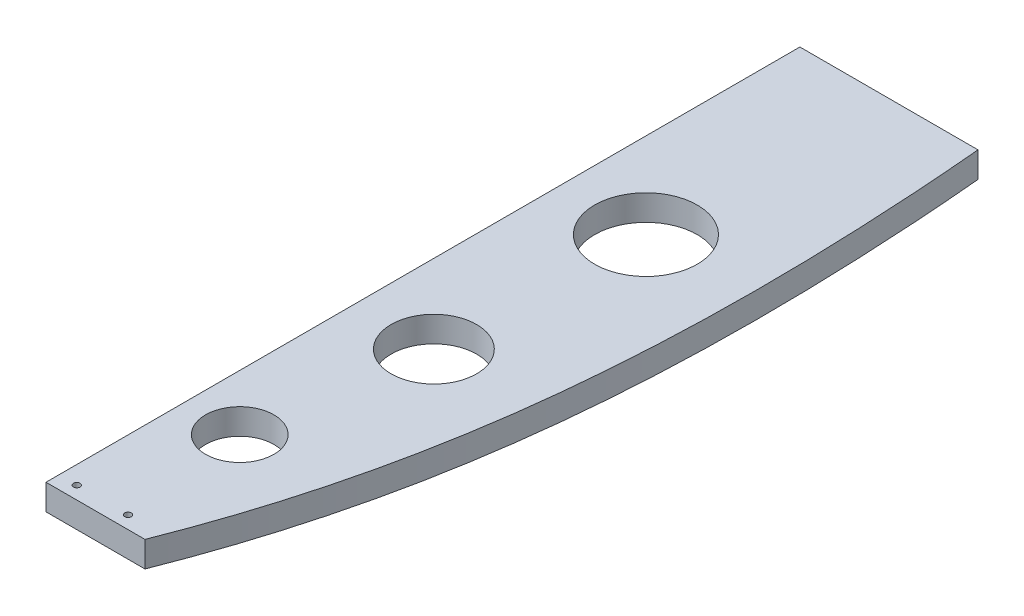
ISO-10303-21;
HEADER;
FILE_DESCRIPTION(('STEP AP214'),'2;1');
FILE_NAME('part.step','',(''),(''),'','','');
FILE_SCHEMA(('AUTOMOTIVE_DESIGN { 1 0 10303 214 1 1 1 1 }'));
ENDSEC;
DATA;
#1=APPLICATION_CONTEXT('core data for automotive mechanical design processes');
#2=APPLICATION_PROTOCOL_DEFINITION('international standard','automotive_design',2000,#1);
#3=PRODUCT_CONTEXT('',#1,'mechanical');
#4=PRODUCT('Part','Part','',(#3));
#5=PRODUCT_RELATED_PRODUCT_CATEGORY('part','',(#4));
#6=PRODUCT_DEFINITION_FORMATION('','',#4);
#7=PRODUCT_DEFINITION_CONTEXT('part definition',#1,'design');
#8=PRODUCT_DEFINITION('design','',#6,#7);
#9=PRODUCT_DEFINITION_SHAPE('','',#8);
#10=(LENGTH_UNIT() NAMED_UNIT(*) SI_UNIT(.MILLI.,.METRE.));
#11=(NAMED_UNIT(*) PLANE_ANGLE_UNIT() SI_UNIT($,.RADIAN.));
#12=(NAMED_UNIT(*) SI_UNIT($,.STERADIAN.) SOLID_ANGLE_UNIT());
#13=UNCERTAINTY_MEASURE_WITH_UNIT(LENGTH_MEASURE(1.E-05),#10,'distance_accuracy_value','');
#14=(GEOMETRIC_REPRESENTATION_CONTEXT(3) GLOBAL_UNCERTAINTY_ASSIGNED_CONTEXT((#13)) GLOBAL_UNIT_ASSIGNED_CONTEXT((#10,
#11,#12)) REPRESENTATION_CONTEXT('',''));
#15=CARTESIAN_POINT('',(0.,0.,0.));
#16=DIRECTION('',(0.,0.,1.));
#17=DIRECTION('',(1.,0.,0.));
#18=AXIS2_PLACEMENT_3D('',#15,#16,#17);
#19=CARTESIAN_POINT('',(395.938510352721,5549.9,2963.39820667187));
#20=DIRECTION('',(0.,1.,0.));
#21=DIRECTION('',(-1.,0.,0.));
#22=AXIS2_PLACEMENT_3D('',#19,#20,#21);
#23=PLANE('',#22);
#24=CARTESIAN_POINT('',(376.528681754789,5549.9,3233.76141324194));
#25=DIRECTION('',(0.,1.,0.));
#26=DIRECTION('',(-1.,0.,0.));
#27=AXIS2_PLACEMENT_3D('',#24,#25,#26);
#28=CIRCLE('',#27,2.45744999999997);
#29=CARTESIAN_POINT('',(374.071231754789,5549.9,3233.76141324194));
#30=VERTEX_POINT('',#29);
#31=EDGE_CURVE('E461',#30,#30,#28,.T.);
#32=ORIENTED_EDGE('',*,*,#31,.T.);
#33=EDGE_LOOP('',(#32));
#34=FACE_BOUND('',#33,.T.);
#35=CARTESIAN_POINT('',(338.428578956982,5549.9,3233.76141324205));
#36=DIRECTION('',(0.,1.,0.));
#37=DIRECTION('',(-1.,0.,0.));
#38=AXIS2_PLACEMENT_3D('',#35,#36,#37);
#39=CIRCLE('',#38,2.45744999999997);
#40=CARTESIAN_POINT('',(335.971128956982,5549.9,3233.76141324205));
#41=VERTEX_POINT('',#40);
#42=EDGE_CURVE('E114',#41,#41,#39,.T.);
#43=ORIENTED_EDGE('',*,*,#42,.T.);
#44=EDGE_LOOP('',(#43));
#45=FACE_BOUND('',#44,.T.);
#46=CARTESIAN_POINT('',(388.619999999984,5549.9,2861.31));
#47=DIRECTION('',(0.,1.,0.));
#48=DIRECTION('',(-1.,0.,0.));
#49=AXIS2_PLACEMENT_3D('',#46,#47,#48);
#50=CIRCLE('',#49,38.0999999999997);
#51=CARTESIAN_POINT('',(350.519999999985,5549.9,2861.31));
#52=VERTEX_POINT('',#51);
#53=EDGE_CURVE('E156',#52,#52,#50,.T.);
#54=ORIENTED_EDGE('',*,*,#53,.T.);
#55=EDGE_LOOP('',(#54));
#56=FACE_BOUND('',#55,.T.);
#57=CARTESIAN_POINT('',(383.539999999984,5549.9,3013.71));
#58=DIRECTION('',(0.,1.,0.));
#59=DIRECTION('',(-1.,0.,0.));
#60=AXIS2_PLACEMENT_3D('',#57,#58,#59);
#61=CIRCLE('',#60,31.75);
#62=CARTESIAN_POINT('',(351.789999999984,5549.9,3013.71));
#63=VERTEX_POINT('',#62);
#64=EDGE_CURVE('E486',#63,#63,#61,.T.);
#65=ORIENTED_EDGE('',*,*,#64,.T.);
#66=EDGE_LOOP('',(#65));
#67=FACE_BOUND('',#66,.T.);
#68=CARTESIAN_POINT('',(366.394999999984,5549.9,3140.71));
#69=DIRECTION('',(0.,1.,0.));
#70=DIRECTION('',(-1.,0.,0.));
#71=AXIS2_PLACEMENT_3D('',#68,#69,#70);
#72=CIRCLE('',#71,25.4);
#73=CARTESIAN_POINT('',(340.994999999984,5549.9,3140.71));
#74=VERTEX_POINT('',#73);
#75=EDGE_CURVE('E170',#74,#74,#72,.T.);
#76=ORIENTED_EDGE('',*,*,#75,.T.);
#77=EDGE_LOOP('',(#76));
#78=FACE_BOUND('',#77,.T.);
#79=DIRECTION('',(0.,0.,1.));
#80=VECTOR('',#79,1.);
#81=CARTESIAN_POINT('',(325.12,5549.9,2683.51));
#82=LINE('',#81,#80);
#83=CARTESIAN_POINT('',(325.12,5549.9,2683.51));
#84=VERTEX_POINT('',#83);
#85=CARTESIAN_POINT('',(325.12,5549.9,3243.28641334377));
#86=VERTEX_POINT('',#85);
#87=EDGE_CURVE('E162',#84,#86,#82,.T.);
#88=ORIENTED_EDGE('',*,*,#87,.F.);
#89=DIRECTION('',(-1.,0.,0.));
#90=VECTOR('',#89,1.);
#91=CARTESIAN_POINT('',(457.383176281734,5549.9,2683.51));
#92=LINE('',#91,#90);
#93=CARTESIAN_POINT('',(457.383176281734,5549.9,2683.51));
#94=VERTEX_POINT('',#93);
#95=EDGE_CURVE('E163',#94,#84,#92,.T.);
#96=ORIENTED_EDGE('',*,*,#95,.F.);
#97=CARTESIAN_POINT('',(398.616067459075,5549.9,3243.28641334377));
#98=CARTESIAN_POINT('',(399.391254354249,5549.9,3241.31643941946));
#99=CARTESIAN_POINT('',(400.159771946542,5549.9,3239.34384037501));
#100=CARTESIAN_POINT('',(401.683308273386,5549.9,3235.39352604281));
#101=CARTESIAN_POINT('',(402.438327540984,5549.9,3233.41581096063));
#102=CARTESIAN_POINT('',(403.934753074234,5549.9,3229.45528302953));
#103=CARTESIAN_POINT('',(404.676159617437,5549.9,3227.47247028548));
#104=CARTESIAN_POINT('',(406.145485254066,5549.9,3223.50115186715));
#105=CARTESIAN_POINT('',(406.873400073381,5549.9,3221.51264461165));
#106=CARTESIAN_POINT('',(408.315409595479,5549.9,3217.53057616089));
#107=CARTESIAN_POINT('',(409.029504010926,5549.9,3215.53701486152));
#108=CARTESIAN_POINT('',(410.443784650398,5549.9,3211.54487773681));
#109=CARTESIAN_POINT('',(411.143970279183,5549.9,3209.54630170097));
#110=CARTESIAN_POINT('',(413.924796825673,5549.9,3201.51873163861));
#111=CARTESIAN_POINT('',(415.948841486582,5549.9,3195.46999950884));
#112=CARTESIAN_POINT('',(419.867867500471,5549.9,3183.33007269644));
#113=CARTESIAN_POINT('',(421.762832082676,5549.9,3177.23887260906));
#114=CARTESIAN_POINT('',(425.422427121145,5549.9,3165.01700514526));
#115=CARTESIAN_POINT('',(427.187049310552,5549.9,3158.88633529227));
#116=CARTESIAN_POINT('',(430.585512685608,5549.9,3146.58889174867));
#117=CARTESIAN_POINT('',(432.219354382257,5549.9,3140.42211819922));
#118=CARTESIAN_POINT('',(435.357372122892,5549.9,3128.05321738843));
#119=CARTESIAN_POINT('',(436.86149932901,5549.9,3121.85107774053));
#120=CARTESIAN_POINT('',(439.740649568868,5549.9,3109.41710957125));
#121=CARTESIAN_POINT('',(441.115676283978,5549.9,3103.18528190178));
#122=CARTESIAN_POINT('',(443.738657817965,5549.9,3090.69501786939));
#123=CARTESIAN_POINT('',(444.986613882393,5549.9,3084.43658176791));
#124=CARTESIAN_POINT('',(447.358070937325,5549.9,3071.89634733286));
#125=CARTESIAN_POINT('',(448.481574270177,5549.9,3065.61454944128));
#126=CARTESIAN_POINT('',(450.9592027724,5549.9,3050.94728471009));
#127=CARTESIAN_POINT('',(452.266536668403,5549.9,3042.553883485));
#128=CARTESIAN_POINT('',(454.674970323465,5549.9,3025.73760485585));
#129=CARTESIAN_POINT('',(455.776068123823,5549.9,3017.3147271726));
#130=CARTESIAN_POINT('',(457.781734473296,5549.9,3000.44559812987));
#131=CARTESIAN_POINT('',(458.686301386225,5549.9,2991.99934657639));
#132=CARTESIAN_POINT('',(460.309158182782,5549.9,2975.08983570134));
#133=CARTESIAN_POINT('',(461.027464844443,5549.9,2966.62657798091));
#134=CARTESIAN_POINT('',(462.288581630136,5549.9,2949.68715658898));
#135=CARTESIAN_POINT('',(462.831394684957,5549.9,2941.21099313538));
#136=CARTESIAN_POINT('',(463.522040592226,5549.9,2928.49034900381));
#137=CARTESIAN_POINT('',(463.73165863672,5549.9,2924.2491150432));
#138=CARTESIAN_POINT('',(464.111045111048,5549.9,2915.76485644083));
#139=CARTESIAN_POINT('',(464.280813611034,5549.9,2911.52183180224));
#140=CARTESIAN_POINT('',(464.543893782736,5549.9,2904.10341936462));
#141=CARTESIAN_POINT('',(464.645692509932,5549.9,2900.92832853059));
#142=CARTESIAN_POINT('',(464.782642510266,5549.9,2896.16524637707));
#143=CARTESIAN_POINT('',(464.825667804945,5549.9,2894.57747907896));
#144=CARTESIAN_POINT('',(464.906437301377,5549.9,2891.40180867515));
#145=CARTESIAN_POINT('',(464.944181497302,5549.9,2889.81390556928));
#146=CARTESIAN_POINT('',(465.049630713982,5549.9,2885.05012986422));
#147=CARTESIAN_POINT('',(465.109555502826,5549.9,2881.87408139542));
#148=CARTESIAN_POINT('',(465.209293669797,5549.9,2875.52166888438));
#149=CARTESIAN_POINT('',(465.24910699861,5549.9,2872.34530484138));
#150=CARTESIAN_POINT('',(465.339279193302,5549.9,2862.81707241095));
#151=CARTESIAN_POINT('',(465.360395446423,5549.9,2856.46490585253));
#152=CARTESIAN_POINT('',(465.328911747632,5549.9,2843.76069302108));
#153=CARTESIAN_POINT('',(465.276310667106,5549.9,2837.40864675138));
#154=CARTESIAN_POINT('',(465.10371715051,5549.9,2824.90056477656));
#155=CARTESIAN_POINT('',(464.985843659626,5549.9,2818.74449953624));
#156=CARTESIAN_POINT('',(464.687072530091,5549.9,2806.43379985709));
#157=CARTESIAN_POINT('',(464.506173786314,5549.9,2800.27916544525));
#158=CARTESIAN_POINT('',(464.083727288669,5549.9,2787.97184820662));
#159=CARTESIAN_POINT('',(463.842178185526,5549.9,2781.81916542631));
#160=CARTESIAN_POINT('',(463.300390781291,5549.9,2769.51628781189));
#161=CARTESIAN_POINT('',(463.000151506003,5549.9,2763.36609302079));
#162=CARTESIAN_POINT('',(462.342479114975,5549.9,2751.06749509507));
#163=CARTESIAN_POINT('',(461.98503422991,5549.9,2744.91909259054));
#164=CARTESIAN_POINT('',(461.214161076097,5549.9,2732.62589828629));
#165=CARTESIAN_POINT('',(460.800733667989,5549.9,2726.48110643251));
#166=CARTESIAN_POINT('',(459.918658659862,5549.9,2714.19573926707));
#167=CARTESIAN_POINT('',(459.450013380929,5549.9,2708.05516378908));
#168=CARTESIAN_POINT('',(458.705858250388,5549.9,2698.84786595679));
#169=CARTESIAN_POINT('',(458.450951410517,5549.9,2695.77946560644));
#170=CARTESIAN_POINT('',(457.927384186114,5549.9,2689.64383870023));
#171=CARTESIAN_POINT('',(457.658723802265,5549.9,2686.57661214431));
#172=CARTESIAN_POINT('',(457.383176281734,5549.9,2683.51));
#173=B_SPLINE_CURVE_WITH_KNOTS('',3,(#97,#98,#99,#100,#101,#102,#103,#104,#105,#106,#107,#108,
#109,#110,#111,#112,#113,#114,#115,#116,#117,#118,#119,#120,#121,#122,#123,#124,#125,#126,#127,
#128,#129,#130,#131,#132,#133,#134,#135,#136,#137,#138,#139,#140,#141,#142,#143,#144,#145,#146,
#147,#148,#149,#150,#151,#152,#153,#154,#155,#156,#157,#158,#159,#160,#161,#162,#163,#164,#165,
#166,#167,#168,#169,#170,#171,#172),.UNSPECIFIED.,.F.,.F.,(4,2,2,2,2,2,2,2,2,2,2,2,2,2,2,2,2,2,
2,2,2,2,2,2,2,2,2,2,2,2,2,2,2,2,2,2,2,4),(0.,6.35100513389818,12.7017589115666,19.0523830586233,
25.4049858028807,31.7577204810343,38.110726446763,57.2443005221602,76.3803558108264,
95.5176237474086,114.654816904936,133.799184095804,152.943005208753,172.086638655152,
191.229911734633,216.710911962581,242.192154180931,267.673608531116,293.152766753605,
318.631499445493,331.370582215211,344.109642558367,353.639740098638,358.404782446424,
363.169830052399,372.699596689318,382.229386692556,401.285492509783,420.34189008003,
438.813133582084,457.284700987463,475.756679362759,494.228964380042,512.705054731665,
531.18086107531,549.655891064217,558.892775373889,568.129659224019),.UNSPECIFIED.);
#174=CARTESIAN_POINT('',(398.616067459075,5549.9,3243.28641334377));
#175=VERTEX_POINT('',#174);
#176=EDGE_CURVE('E81',#175,#94,#173,.T.);
#177=ORIENTED_EDGE('',*,*,#176,.F.);
#178=DIRECTION('',(1.,0.,0.));
#179=VECTOR('',#178,1.);
#180=CARTESIAN_POINT('',(325.12,5549.9,3243.28641334377));
#181=LINE('',#180,#179);
#182=EDGE_CURVE('E188',#86,#175,#181,.T.);
#183=ORIENTED_EDGE('',*,*,#182,.F.);
#184=EDGE_LOOP('',(#88,#96,#177,#183));
#185=FACE_BOUND('',#184,.T.);
#186=ADVANCED_FACE('F35',(#34,#45,#56,#67,#78,#185),#23,.F.);
#187=CARTESIAN_POINT('',(325.12,5549.9,3243.28641334377));
#188=DIRECTION('',(0.,0.,1.));
#189=DIRECTION('',(1.,0.,0.));
#190=AXIS2_PLACEMENT_3D('',#187,#188,#189);
#191=PLANE('',#190);
#192=DIRECTION('',(-1.,0.,0.));
#193=VECTOR('',#192,1.);
#194=CARTESIAN_POINT('',(395.938510352721,5568.95,3243.28641334377));
#195=LINE('',#194,#193);
#196=CARTESIAN_POINT('',(325.12,5568.95,3243.28641334377));
#197=VERTEX_POINT('',#196);
#198=CARTESIAN_POINT('',(398.616067459077,5568.95,3243.28641334377));
#199=VERTEX_POINT('',#198);
#200=EDGE_CURVE('E153',#197,#199,#195,.F.);
#201=ORIENTED_EDGE('',*,*,#200,.F.);
#202=DIRECTION('',(0.,-1.,0.));
#203=VECTOR('',#202,1.);
#204=CARTESIAN_POINT('',(325.12,5549.9,3243.28641334377));
#205=LINE('',#204,#203);
#206=EDGE_CURVE('E171',#86,#197,#205,.F.);
#207=ORIENTED_EDGE('',*,*,#206,.F.);
#208=ORIENTED_EDGE('',*,*,#182,.T.);
#209=DIRECTION('',(-1.36956646082368E-13,-1.,0.));
#210=VECTOR('',#209,1.);
#211=CARTESIAN_POINT('',(398.616067459076,5559.425,3243.28641334377));
#212=LINE('',#211,#210);
#213=EDGE_CURVE('E174',#199,#175,#212,.T.);
#214=ORIENTED_EDGE('',*,*,#213,.F.);
#215=EDGE_LOOP('',(#201,#207,#208,#214));
#216=FACE_BOUND('',#215,.T.);
#217=ADVANCED_FACE('F232',(#216),#191,.T.);
#218=CARTESIAN_POINT('',(398.616067459075,5549.9,3243.28641334377));
#219=CARTESIAN_POINT('',(398.616067459077,5568.95,3243.28641334377));
#220=CARTESIAN_POINT('',(438.958601174539,5549.9,3140.76412449457));
#221=CARTESIAN_POINT('',(438.958601174542,5568.95,3140.76412449457));
#222=CARTESIAN_POINT('',(461.136779739803,5549.9,3031.41462020298));
#223=CARTESIAN_POINT('',(461.136779739803,5568.95,3031.41462020298));
#224=CARTESIAN_POINT('',(466.748734721918,5549.9,2823.19952309334));
#225=CARTESIAN_POINT('',(466.748734721918,5568.95,2823.19952309334));
#226=CARTESIAN_POINT('',(463.282210542618,5549.9,2749.16015817366));
#227=CARTESIAN_POINT('',(463.282210542618,5568.95,2749.16015817366));
#228=CARTESIAN_POINT('',(457.383176281734,5549.9,2683.51));
#229=CARTESIAN_POINT('',(457.383176281734,5568.95,2683.51));
#230=B_SPLINE_SURFACE_WITH_KNOTS('',3,1,((#218,#219),(#220,#221),(#222,#223),(#224,#225),(#226,
#227),(#228,#229)),.UNSPECIFIED.,.F.,.F.,.F.,(4,2,4),(2,2),(-55.3716029639308,-25.0699273348478,
-9.0667694452729),(0.,1.90499999999997),.UNSPECIFIED.);
#231=CARTESIAN_POINT('',(398.616067459077,5568.95,3243.28641334377));
#232=CARTESIAN_POINT('',(399.391254354252,5568.95,3241.31643941946));
#233=CARTESIAN_POINT('',(400.159771946544,5568.95,3239.34384037501));
#234=CARTESIAN_POINT('',(401.683308273389,5568.95,3235.39352604281));
#235=CARTESIAN_POINT('',(402.438327540987,5568.95,3233.41581096063));
#236=CARTESIAN_POINT('',(403.934753074236,5568.95,3229.45528302953));
#237=CARTESIAN_POINT('',(404.67615961744,5568.95,3227.47247028548));
#238=CARTESIAN_POINT('',(406.145485254068,5568.95,3223.50115186715));
#239=CARTESIAN_POINT('',(406.873400073383,5568.95,3221.51264461165));
#240=CARTESIAN_POINT('',(408.315409595482,5568.95,3217.53057616089));
#241=CARTESIAN_POINT('',(409.029504010929,5568.95,3215.53701486152));
#242=CARTESIAN_POINT('',(410.443784650401,5568.95,3211.54487773681));
#243=CARTESIAN_POINT('',(411.143970279186,5568.95,3209.54630170097));
#244=CARTESIAN_POINT('',(413.924796825675,5568.95,3201.51873163861));
#245=CARTESIAN_POINT('',(415.948841486584,5568.95,3195.46999950884));
#246=CARTESIAN_POINT('',(419.867867500473,5568.95,3183.33007269644));
#247=CARTESIAN_POINT('',(421.762832082679,5568.95,3177.23887260905));
#248=CARTESIAN_POINT('',(425.422427121148,5568.95,3165.01700514525));
#249=CARTESIAN_POINT('',(427.187049310555,5568.95,3158.88633529227));
#250=CARTESIAN_POINT('',(430.58551268561,5568.95,3146.58889174867));
#251=CARTESIAN_POINT('',(432.21935438226,5568.95,3140.42211819922));
#252=CARTESIAN_POINT('',(435.357372122894,5568.95,3128.05321738843));
#253=CARTESIAN_POINT('',(436.861499329012,5568.95,3121.85107774053));
#254=CARTESIAN_POINT('',(439.74064956887,5568.95,3109.41710957125));
#255=CARTESIAN_POINT('',(441.11567628398,5568.95,3103.18528190178));
#256=CARTESIAN_POINT('',(443.738657817967,5568.95,3090.69501786939));
#257=CARTESIAN_POINT('',(444.986613882395,5568.95,3084.43658176791));
#258=CARTESIAN_POINT('',(447.358070937327,5568.95,3071.89634733286));
#259=CARTESIAN_POINT('',(448.481574270178,5568.95,3065.61454944128));
#260=CARTESIAN_POINT('',(450.959202772401,5568.95,3050.94728471008));
#261=CARTESIAN_POINT('',(452.266536668404,5568.95,3042.553883485));
#262=CARTESIAN_POINT('',(454.674970323466,5568.95,3025.73760485584));
#263=CARTESIAN_POINT('',(455.776068123824,5568.95,3017.3147271726));
#264=CARTESIAN_POINT('',(457.781734473297,5568.95,3000.44559812987));
#265=CARTESIAN_POINT('',(458.686301386226,5568.95,2991.99934657639));
#266=CARTESIAN_POINT('',(460.309158182783,5568.95,2975.08983570133));
#267=CARTESIAN_POINT('',(461.027464844443,5568.95,2966.62657798091));
#268=CARTESIAN_POINT('',(462.288581630136,5568.95,2949.68715658898));
#269=CARTESIAN_POINT('',(462.831394684957,5568.95,2941.21099313538));
#270=CARTESIAN_POINT('',(463.522040592226,5568.95,2928.49034900381));
#271=CARTESIAN_POINT('',(463.73165863672,5568.95,2924.2491150432));
#272=CARTESIAN_POINT('',(464.111045111048,5568.95,2915.76485644083));
#273=CARTESIAN_POINT('',(464.280813611034,5568.95,2911.52183180224));
#274=CARTESIAN_POINT('',(464.543893782736,5568.95,2904.10341936462));
#275=CARTESIAN_POINT('',(464.645692509933,5568.95,2900.92832853059));
#276=CARTESIAN_POINT('',(464.782642510266,5568.95,2896.16524637706));
#277=CARTESIAN_POINT('',(464.825667804945,5568.95,2894.57747907896));
#278=CARTESIAN_POINT('',(464.906437301377,5568.95,2891.40180867514));
#279=CARTESIAN_POINT('',(464.944181497302,5568.95,2889.81390556928));
#280=CARTESIAN_POINT('',(465.049630713982,5568.95,2885.05012986421));
#281=CARTESIAN_POINT('',(465.109555502827,5568.95,2881.87408139542));
#282=CARTESIAN_POINT('',(465.209293669797,5568.95,2875.52166888437));
#283=CARTESIAN_POINT('',(465.24910699861,5568.95,2872.34530484138));
#284=CARTESIAN_POINT('',(465.339279193302,5568.95,2862.81707241094));
#285=CARTESIAN_POINT('',(465.360395446423,5568.95,2856.46490585253));
#286=CARTESIAN_POINT('',(465.328911747632,5568.95,2843.76069302108));
#287=CARTESIAN_POINT('',(465.276310667106,5568.95,2837.40864675138));
#288=CARTESIAN_POINT('',(465.10371715051,5568.95,2824.90056477656));
#289=CARTESIAN_POINT('',(464.985843659626,5568.95,2818.74449953624));
#290=CARTESIAN_POINT('',(464.687072530091,5568.95,2806.43379985709));
#291=CARTESIAN_POINT('',(464.506173786313,5568.95,2800.27916544525));
#292=CARTESIAN_POINT('',(464.083727288669,5568.95,2787.97184820662));
#293=CARTESIAN_POINT('',(463.842178185526,5568.95,2781.81916542631));
#294=CARTESIAN_POINT('',(463.300390781291,5568.95,2769.51628781189));
#295=CARTESIAN_POINT('',(463.000151506003,5568.95,2763.36609302078));
#296=CARTESIAN_POINT('',(462.342479114975,5568.95,2751.06749509507));
#297=CARTESIAN_POINT('',(461.98503422991,5568.95,2744.91909259054));
#298=CARTESIAN_POINT('',(461.214161076097,5568.95,2732.62589828628));
#299=CARTESIAN_POINT('',(460.800733667989,5568.95,2726.48110643251));
#300=CARTESIAN_POINT('',(459.918658659862,5568.95,2714.19573926707));
#301=CARTESIAN_POINT('',(459.450013380929,5568.95,2708.05516378908));
#302=CARTESIAN_POINT('',(458.705858250388,5568.95,2698.84786595678));
#303=CARTESIAN_POINT('',(458.450951410517,5568.95,2695.77946560644));
#304=CARTESIAN_POINT('',(457.927384186114,5568.95,2689.64383870023));
#305=CARTESIAN_POINT('',(457.658723802265,5568.95,2686.57661214431));
#306=CARTESIAN_POINT('',(457.383176281734,5568.95,2683.51));
#307=B_SPLINE_CURVE_WITH_KNOTS('',3,(#231,#232,#233,#234,#235,#236,#237,#238,#239,#240,#241,
#242,#243,#244,#245,#246,#247,#248,#249,#250,#251,#252,#253,#254,#255,#256,#257,#258,#259,#260,
#261,#262,#263,#264,#265,#266,#267,#268,#269,#270,#271,#272,#273,#274,#275,#276,#277,#278,#279,
#280,#281,#282,#283,#284,#285,#286,#287,#288,#289,#290,#291,#292,#293,#294,#295,#296,#297,#298,
#299,#300,#301,#302,#303,#304,#305,#306),.UNSPECIFIED.,.F.,.F.,(4,2,2,2,2,2,2,2,2,2,2,2,2,2,2,2,
2,2,2,2,2,2,2,2,2,2,2,2,2,2,2,2,2,2,2,2,2,4),(0.,6.35100513389873,12.7017589115675,
19.052383058624,25.4049858028812,31.7577204810353,38.1107264467643,57.2443005221619,
76.3803558108276,95.5176237474098,114.654816904938,133.799184095806,152.943005208755,
172.086638655154,191.229911734635,216.710911962584,242.192154180932,267.673608531119,
293.152766753607,318.631499445496,331.370582215213,344.109642558369,353.63974009864,
358.404782446426,363.169830052401,372.69959668932,382.229386692558,401.285492509786,
420.341890080032,438.813133582086,457.284700987465,475.756679362761,494.228964380043,
512.705054731665,531.180861075311,549.655891064217,558.892775373888,568.129659224018),.UNSPECIFIED.);
#308=CARTESIAN_POINT('',(457.383176281734,5568.95,2683.51));
#309=VERTEX_POINT('',#308);
#310=EDGE_CURVE('E150',#199,#309,#307,.T.);
#311=DIRECTION('',(0.,1.,0.));
#312=VECTOR('',#311,1.);
#313=CARTESIAN_POINT('',(457.383176281734,5549.9,2683.51));
#314=LINE('',#313,#312);
#315=EDGE_CURVE('E159',#309,#94,#314,.F.);
#316=ORIENTED_EDGE('',*,*,#310,.F.);
#317=ORIENTED_EDGE('',*,*,#213,.T.);
#318=ORIENTED_EDGE('',*,*,#176,.T.);
#319=ORIENTED_EDGE('',*,*,#315,.F.);
#320=EDGE_LOOP('',(#316,#317,#318,#319));
#321=FACE_BOUND('',#320,.T.);
#322=ADVANCED_FACE('F37',(#321),#230,.T.);
#323=CARTESIAN_POINT('',(457.383176281734,5549.9,2683.51));
#324=DIRECTION('',(0.,0.,-1.));
#325=DIRECTION('',(-1.,0.,0.));
#326=AXIS2_PLACEMENT_3D('',#323,#324,#325);
#327=PLANE('',#326);
#328=CARTESIAN_POINT('',(424.072610901228,5559.425,2683.51));
#329=DIRECTION('',(0.,0.,-1.));
#330=DIRECTION('',(-1.,0.,0.));
#331=AXIS2_PLACEMENT_3D('',#328,#329,#330);
#332=CIRCLE('',#331,0.991870000000006);
#333=CARTESIAN_POINT('',(423.080740901228,5559.425,2683.51));
#334=VERTEX_POINT('',#333);
#335=EDGE_CURVE('E141',#334,#334,#332,.T.);
#336=ORIENTED_EDGE('',*,*,#335,.F.);
#337=EDGE_LOOP('',(#336));
#338=FACE_BOUND('',#337,.T.);
#339=CARTESIAN_POINT('',(358.104203633743,5559.425,2683.51));
#340=DIRECTION('',(0.,0.,-1.));
#341=DIRECTION('',(-1.,0.,0.));
#342=AXIS2_PLACEMENT_3D('',#339,#340,#341);
#343=CIRCLE('',#342,0.991870000000006);
#344=CARTESIAN_POINT('',(357.112333633743,5559.425,2683.51));
#345=VERTEX_POINT('',#344);
#346=EDGE_CURVE('E145',#345,#345,#343,.T.);
#347=ORIENTED_EDGE('',*,*,#346,.F.);
#348=EDGE_LOOP('',(#347));
#349=FACE_BOUND('',#348,.T.);
#350=DIRECTION('',(-1.,0.,0.));
#351=VECTOR('',#350,1.);
#352=CARTESIAN_POINT('',(395.938510352721,5568.95,2683.51));
#353=LINE('',#352,#351);
#354=CARTESIAN_POINT('',(325.12,5568.95,2683.51));
#355=VERTEX_POINT('',#354);
#356=EDGE_CURVE('E146',#309,#355,#353,.T.);
#357=ORIENTED_EDGE('',*,*,#356,.F.);
#358=ORIENTED_EDGE('',*,*,#315,.T.);
#359=ORIENTED_EDGE('',*,*,#95,.T.);
#360=DIRECTION('',(0.,-1.,0.));
#361=VECTOR('',#360,1.);
#362=CARTESIAN_POINT('',(325.12,5549.9,2683.51));
#363=LINE('',#362,#361);
#364=EDGE_CURVE('E57',#355,#84,#363,.T.);
#365=ORIENTED_EDGE('',*,*,#364,.F.);
#366=EDGE_LOOP('',(#357,#358,#359,#365));
#367=FACE_BOUND('',#366,.T.);
#368=ADVANCED_FACE('F227',(#338,#349,#367),#327,.T.);
#369=CARTESIAN_POINT('',(325.12,5549.9,2683.51));
#370=DIRECTION('',(-1.,0.,0.));
#371=DIRECTION('',(0.,-1.,0.));
#372=AXIS2_PLACEMENT_3D('',#369,#370,#371);
#373=PLANE('',#372);
#374=CARTESIAN_POINT('',(325.12,5559.425,2785.11));
#375=DIRECTION('',(-1.,0.,0.));
#376=DIRECTION('',(0.,-1.,0.));
#377=AXIS2_PLACEMENT_3D('',#374,#375,#376);
#378=CIRCLE('',#377,0.991870000000006);
#379=CARTESIAN_POINT('',(325.12,5558.43313,2785.11));
#380=VERTEX_POINT('',#379);
#381=EDGE_CURVE('E42',#380,#380,#378,.T.);
#382=ORIENTED_EDGE('',*,*,#381,.F.);
#383=EDGE_LOOP('',(#382));
#384=FACE_BOUND('',#383,.T.);
#385=CARTESIAN_POINT('',(325.12,5559.425,2886.71));
#386=DIRECTION('',(-1.,0.,0.));
#387=DIRECTION('',(0.,-1.,0.));
#388=AXIS2_PLACEMENT_3D('',#385,#386,#387);
#389=CIRCLE('',#388,0.991870000000006);
#390=CARTESIAN_POINT('',(325.12,5558.43313,2886.71));
#391=VERTEX_POINT('',#390);
#392=EDGE_CURVE('E125',#391,#391,#389,.T.);
#393=ORIENTED_EDGE('',*,*,#392,.F.);
#394=EDGE_LOOP('',(#393));
#395=FACE_BOUND('',#394,.T.);
#396=CARTESIAN_POINT('',(325.12,5559.425,2988.31));
#397=DIRECTION('',(-1.,0.,0.));
#398=DIRECTION('',(0.,-1.,0.));
#399=AXIS2_PLACEMENT_3D('',#396,#397,#398);
#400=CIRCLE('',#399,0.991870000000006);
#401=CARTESIAN_POINT('',(325.12,5558.43313,2988.31));
#402=VERTEX_POINT('',#401);
#403=EDGE_CURVE('E129',#402,#402,#400,.T.);
#404=ORIENTED_EDGE('',*,*,#403,.F.);
#405=EDGE_LOOP('',(#404));
#406=FACE_BOUND('',#405,.T.);
#407=CARTESIAN_POINT('',(325.12,5559.425,3089.91));
#408=DIRECTION('',(-1.,0.,0.));
#409=DIRECTION('',(0.,-1.,0.));
#410=AXIS2_PLACEMENT_3D('',#407,#408,#409);
#411=CIRCLE('',#410,0.991870000000006);
#412=CARTESIAN_POINT('',(325.12,5558.43313,3089.91));
#413=VERTEX_POINT('',#412);
#414=EDGE_CURVE('E133',#413,#413,#411,.T.);
#415=ORIENTED_EDGE('',*,*,#414,.F.);
#416=EDGE_LOOP('',(#415));
#417=FACE_BOUND('',#416,.T.);
#418=CARTESIAN_POINT('',(325.12,5559.425,3191.51));
#419=DIRECTION('',(-1.,0.,0.));
#420=DIRECTION('',(0.,-1.,0.));
#421=AXIS2_PLACEMENT_3D('',#418,#419,#420);
#422=CIRCLE('',#421,0.991870000000006);
#423=CARTESIAN_POINT('',(325.12,5558.43313,3191.51));
#424=VERTEX_POINT('',#423);
#425=EDGE_CURVE('E137',#424,#424,#422,.T.);
#426=ORIENTED_EDGE('',*,*,#425,.F.);
#427=EDGE_LOOP('',(#426));
#428=FACE_BOUND('',#427,.T.);
#429=DIRECTION('',(0.,0.,1.));
#430=VECTOR('',#429,1.);
#431=CARTESIAN_POINT('',(325.12,5568.95,2963.39820667187));
#432=LINE('',#431,#430);
#433=EDGE_CURVE('E149',#355,#197,#432,.T.);
#434=ORIENTED_EDGE('',*,*,#433,.F.);
#435=ORIENTED_EDGE('',*,*,#364,.T.);
#436=ORIENTED_EDGE('',*,*,#87,.T.);
#437=ORIENTED_EDGE('',*,*,#206,.T.);
#438=EDGE_LOOP('',(#434,#435,#436,#437));
#439=FACE_BOUND('',#438,.T.);
#440=ADVANCED_FACE('F223',(#384,#395,#406,#417,#428,#439),#373,.T.);
#441=CARTESIAN_POINT('',(366.395,5194.3,3140.71));
#442=DIRECTION('',(0.,1.,0.));
#443=DIRECTION('',(-1.,0.,0.));
#444=AXIS2_PLACEMENT_3D('',#441,#442,#443);
#445=CYLINDRICAL_SURFACE('',#444,25.4);
#446=ORIENTED_EDGE('',*,*,#75,.F.);
#447=EDGE_LOOP('',(#446));
#448=FACE_BOUND('',#447,.T.);
#449=CARTESIAN_POINT('',(366.394999999984,5568.95,3140.71));
#450=DIRECTION('',(0.,1.,0.));
#451=DIRECTION('',(-1.,0.,0.));
#452=AXIS2_PLACEMENT_3D('',#449,#450,#451);
#453=CIRCLE('',#452,25.4);
#454=CARTESIAN_POINT('',(340.994999999984,5568.95,3140.71));
#455=VERTEX_POINT('',#454);
#456=EDGE_CURVE('E166',#455,#455,#453,.F.);
#457=ORIENTED_EDGE('',*,*,#456,.F.);
#458=EDGE_LOOP('',(#457));
#459=FACE_BOUND('',#458,.T.);
#460=ADVANCED_FACE('F219',(#448,#459),#445,.F.);
#461=CARTESIAN_POINT('',(383.54,5194.3,3013.71));
#462=DIRECTION('',(0.,1.,0.));
#463=DIRECTION('',(-1.,0.,0.));
#464=AXIS2_PLACEMENT_3D('',#461,#462,#463);
#465=CYLINDRICAL_SURFACE('',#464,31.75);
#466=ORIENTED_EDGE('',*,*,#64,.F.);
#467=EDGE_LOOP('',(#466));
#468=FACE_BOUND('',#467,.T.);
#469=CARTESIAN_POINT('',(383.539999999983,5568.95,3013.71));
#470=DIRECTION('',(0.,1.,0.));
#471=DIRECTION('',(-1.,0.,0.));
#472=AXIS2_PLACEMENT_3D('',#469,#470,#471);
#473=CIRCLE('',#472,31.75);
#474=CARTESIAN_POINT('',(351.789999999983,5568.95,3013.71));
#475=VERTEX_POINT('',#474);
#476=EDGE_CURVE('E48',#475,#475,#473,.F.);
#477=ORIENTED_EDGE('',*,*,#476,.F.);
#478=EDGE_LOOP('',(#477));
#479=FACE_BOUND('',#478,.T.);
#480=ADVANCED_FACE('F215',(#468,#479),#465,.F.);
#481=CARTESIAN_POINT('',(388.62,5194.3,2861.31));
#482=DIRECTION('',(0.,1.,0.));
#483=DIRECTION('',(-1.,0.,0.));
#484=AXIS2_PLACEMENT_3D('',#481,#482,#483);
#485=CYLINDRICAL_SURFACE('',#484,38.0999999999997);
#486=ORIENTED_EDGE('',*,*,#53,.F.);
#487=EDGE_LOOP('',(#486));
#488=FACE_BOUND('',#487,.T.);
#489=CARTESIAN_POINT('',(388.619999999984,5568.95,2861.31));
#490=DIRECTION('',(0.,1.,0.));
#491=DIRECTION('',(-1.,0.,0.));
#492=AXIS2_PLACEMENT_3D('',#489,#490,#491);
#493=CIRCLE('',#492,38.0999999999997);
#494=CARTESIAN_POINT('',(350.519999999984,5568.95,2861.31));
#495=VERTEX_POINT('',#494);
#496=EDGE_CURVE('E11',#495,#495,#493,.F.);
#497=ORIENTED_EDGE('',*,*,#496,.F.);
#498=EDGE_LOOP('',(#497));
#499=FACE_BOUND('',#498,.T.);
#500=ADVANCED_FACE('F210',(#488,#499),#485,.F.);
#501=CARTESIAN_POINT('',(395.938510352721,5568.95,2963.39820667187));
#502=DIRECTION('',(0.,1.,0.));
#503=DIRECTION('',(-1.,0.,0.));
#504=AXIS2_PLACEMENT_3D('',#501,#502,#503);
#505=PLANE('',#504);
#506=CARTESIAN_POINT('',(376.528681754789,5568.95,3233.76141324194));
#507=DIRECTION('',(0.,1.,0.));
#508=DIRECTION('',(0.,0.,1.));
#509=AXIS2_PLACEMENT_3D('',#506,#507,#508);
#510=CIRCLE('',#509,2.45744999999997);
#511=CARTESIAN_POINT('',(376.528681754789,5568.95,3236.21886324194));
#512=VERTEX_POINT('',#511);
#513=EDGE_CURVE('E458',#512,#512,#510,.T.);
#514=ORIENTED_EDGE('',*,*,#513,.F.);
#515=EDGE_LOOP('',(#514));
#516=FACE_BOUND('',#515,.T.);
#517=CARTESIAN_POINT('',(338.428578956982,5568.95,3233.76141324205));
#518=DIRECTION('',(0.,1.,0.));
#519=DIRECTION('',(0.,0.,1.));
#520=AXIS2_PLACEMENT_3D('',#517,#518,#519);
#521=CIRCLE('',#520,2.45744999999997);
#522=CARTESIAN_POINT('',(338.428578956982,5568.95,3236.21886324205));
#523=VERTEX_POINT('',#522);
#524=EDGE_CURVE('E119',#523,#523,#521,.T.);
#525=ORIENTED_EDGE('',*,*,#524,.F.);
#526=EDGE_LOOP('',(#525));
#527=FACE_BOUND('',#526,.T.);
#528=ORIENTED_EDGE('',*,*,#496,.T.);
#529=EDGE_LOOP('',(#528));
#530=FACE_BOUND('',#529,.T.);
#531=ORIENTED_EDGE('',*,*,#476,.T.);
#532=EDGE_LOOP('',(#531));
#533=FACE_BOUND('',#532,.T.);
#534=ORIENTED_EDGE('',*,*,#456,.T.);
#535=EDGE_LOOP('',(#534));
#536=FACE_BOUND('',#535,.T.);
#537=ORIENTED_EDGE('',*,*,#356,.T.);
#538=ORIENTED_EDGE('',*,*,#433,.T.);
#539=ORIENTED_EDGE('',*,*,#200,.T.);
#540=ORIENTED_EDGE('',*,*,#310,.T.);
#541=EDGE_LOOP('',(#537,#538,#539,#540));
#542=FACE_BOUND('',#541,.T.);
#543=ADVANCED_FACE('F204',(#516,#527,#530,#533,#536,#542),#505,.T.);
#544=CARTESIAN_POINT('',(358.104203633743,5559.425,2702.56));
#545=DIRECTION('',(0.,0.,-1.));
#546=DIRECTION('',(-1.,0.,0.));
#547=AXIS2_PLACEMENT_3D('',#544,#545,#546);
#548=CONICAL_SURFACE('',#547,0.991870000000006,1.02974425867677);
#549=CARTESIAN_POINT('',(358.104203633743,5559.425,2703.1559756222));
#550=VERTEX_POINT('',#549);
#551=VERTEX_LOOP('',#550);
#552=FACE_BOUND('',#551,.T.);
#553=CARTESIAN_POINT('',(358.104203633743,5559.425,2702.56));
#554=DIRECTION('',(0.,0.,-1.));
#555=DIRECTION('',(-1.,0.,0.));
#556=AXIS2_PLACEMENT_3D('',#553,#554,#555);
#557=CIRCLE('',#556,0.991870000000006);
#558=CARTESIAN_POINT('',(357.112333633743,5559.425,2702.56));
#559=VERTEX_POINT('',#558);
#560=EDGE_CURVE('E142',#559,#559,#557,.T.);
#561=ORIENTED_EDGE('',*,*,#560,.T.);
#562=EDGE_LOOP('',(#561));
#563=FACE_BOUND('',#562,.T.);
#564=ADVANCED_FACE('F209',(#552,#563),#548,.F.);
#565=CARTESIAN_POINT('',(358.104203633743,5559.425,2664.46));
#566=DIRECTION('',(0.,0.,-1.));
#567=DIRECTION('',(-1.,0.,0.));
#568=AXIS2_PLACEMENT_3D('',#565,#566,#567);
#569=CYLINDRICAL_SURFACE('',#568,0.991870000000006);
#570=ORIENTED_EDGE('',*,*,#346,.T.);
#571=EDGE_LOOP('',(#570));
#572=FACE_BOUND('',#571,.T.);
#573=ORIENTED_EDGE('',*,*,#560,.F.);
#574=EDGE_LOOP('',(#573));
#575=FACE_BOUND('',#574,.T.);
#576=ADVANCED_FACE('F315',(#572,#575),#569,.F.);
#577=CARTESIAN_POINT('',(424.072610901228,5559.425,2702.56));
#578=DIRECTION('',(0.,0.,-1.));
#579=DIRECTION('',(-1.,0.,0.));
#580=AXIS2_PLACEMENT_3D('',#577,#578,#579);
#581=CONICAL_SURFACE('',#580,0.991870000000006,1.02974425867677);
#582=CARTESIAN_POINT('',(424.072610901228,5559.425,2703.1559756222));
#583=VERTEX_POINT('',#582);
#584=VERTEX_LOOP('',#583);
#585=FACE_BOUND('',#584,.T.);
#586=CARTESIAN_POINT('',(424.072610901228,5559.425,2702.56));
#587=DIRECTION('',(0.,0.,-1.));
#588=DIRECTION('',(-1.,0.,0.));
#589=AXIS2_PLACEMENT_3D('',#586,#587,#588);
#590=CIRCLE('',#589,0.991870000000006);
#591=CARTESIAN_POINT('',(423.080740901228,5559.425,2702.56));
#592=VERTEX_POINT('',#591);
#593=EDGE_CURVE('E138',#592,#592,#590,.T.);
#594=ORIENTED_EDGE('',*,*,#593,.T.);
#595=EDGE_LOOP('',(#594));
#596=FACE_BOUND('',#595,.T.);
#597=ADVANCED_FACE('F320',(#585,#596),#581,.F.);
#598=CARTESIAN_POINT('',(424.072610901228,5559.425,2664.46));
#599=DIRECTION('',(0.,0.,-1.));
#600=DIRECTION('',(-1.,0.,0.));
#601=AXIS2_PLACEMENT_3D('',#598,#599,#600);
#602=CYLINDRICAL_SURFACE('',#601,0.991870000000006);
#603=ORIENTED_EDGE('',*,*,#335,.T.);
#604=EDGE_LOOP('',(#603));
#605=FACE_BOUND('',#604,.T.);
#606=ORIENTED_EDGE('',*,*,#593,.F.);
#607=EDGE_LOOP('',(#606));
#608=FACE_BOUND('',#607,.T.);
#609=ADVANCED_FACE('F327',(#605,#608),#602,.F.);
#610=CARTESIAN_POINT('',(344.17,5559.425,3191.51));
#611=DIRECTION('',(-1.,0.,0.));
#612=DIRECTION('',(0.,0.,1.));
#613=AXIS2_PLACEMENT_3D('',#610,#611,#612);
#614=CONICAL_SURFACE('',#613,0.991870000000006,1.02974425867665);
#615=CARTESIAN_POINT('',(344.765975622195,5559.425,3191.51));
#616=VERTEX_POINT('',#615);
#617=VERTEX_LOOP('',#616);
#618=FACE_BOUND('',#617,.T.);
#619=CARTESIAN_POINT('',(344.17,5559.425,3191.51));
#620=DIRECTION('',(-1.,0.,0.));
#621=DIRECTION('',(0.,0.,1.));
#622=AXIS2_PLACEMENT_3D('',#619,#620,#621);
#623=CIRCLE('',#622,0.991870000000006);
#624=CARTESIAN_POINT('',(344.17,5559.425,3192.50187));
#625=VERTEX_POINT('',#624);
#626=EDGE_CURVE('E134',#625,#625,#623,.T.);
#627=ORIENTED_EDGE('',*,*,#626,.T.);
#628=EDGE_LOOP('',(#627));
#629=FACE_BOUND('',#628,.T.);
#630=ADVANCED_FACE('F333',(#618,#629),#614,.F.);
#631=CARTESIAN_POINT('',(312.42,5559.425,3191.51));
#632=DIRECTION('',(-1.,0.,0.));
#633=DIRECTION('',(0.,0.,1.));
#634=AXIS2_PLACEMENT_3D('',#631,#632,#633);
#635=CYLINDRICAL_SURFACE('',#634,0.991870000000006);
#636=ORIENTED_EDGE('',*,*,#425,.T.);
#637=EDGE_LOOP('',(#636));
#638=FACE_BOUND('',#637,.T.);
#639=ORIENTED_EDGE('',*,*,#626,.F.);
#640=EDGE_LOOP('',(#639));
#641=FACE_BOUND('',#640,.T.);
#642=ADVANCED_FACE('F340',(#638,#641),#635,.F.);
#643=CARTESIAN_POINT('',(344.17,5559.425,3089.91));
#644=DIRECTION('',(-1.,0.,0.));
#645=DIRECTION('',(0.,0.,1.));
#646=AXIS2_PLACEMENT_3D('',#643,#644,#645);
#647=CONICAL_SURFACE('',#646,0.991870000000006,1.02974425867665);
#648=CARTESIAN_POINT('',(344.765975622195,5559.425,3089.91));
#649=VERTEX_POINT('',#648);
#650=VERTEX_LOOP('',#649);
#651=FACE_BOUND('',#650,.T.);
#652=CARTESIAN_POINT('',(344.17,5559.425,3089.91));
#653=DIRECTION('',(-1.,0.,0.));
#654=DIRECTION('',(0.,0.,1.));
#655=AXIS2_PLACEMENT_3D('',#652,#653,#654);
#656=CIRCLE('',#655,0.991870000000006);
#657=CARTESIAN_POINT('',(344.17,5559.425,3090.90187));
#658=VERTEX_POINT('',#657);
#659=EDGE_CURVE('E130',#658,#658,#656,.T.);
#660=ORIENTED_EDGE('',*,*,#659,.T.);
#661=EDGE_LOOP('',(#660));
#662=FACE_BOUND('',#661,.T.);
#663=ADVANCED_FACE('F348',(#651,#662),#647,.F.);
#664=CARTESIAN_POINT('',(312.42,5559.425,3089.91));
#665=DIRECTION('',(-1.,0.,0.));
#666=DIRECTION('',(0.,0.,1.));
#667=AXIS2_PLACEMENT_3D('',#664,#665,#666);
#668=CYLINDRICAL_SURFACE('',#667,0.991870000000006);
#669=ORIENTED_EDGE('',*,*,#414,.T.);
#670=EDGE_LOOP('',(#669));
#671=FACE_BOUND('',#670,.T.);
#672=ORIENTED_EDGE('',*,*,#659,.F.);
#673=EDGE_LOOP('',(#672));
#674=FACE_BOUND('',#673,.T.);
#675=ADVANCED_FACE('F356',(#671,#674),#668,.F.);
#676=CARTESIAN_POINT('',(344.17,5559.425,2988.31));
#677=DIRECTION('',(-1.,0.,0.));
#678=DIRECTION('',(0.,0.,1.));
#679=AXIS2_PLACEMENT_3D('',#676,#677,#678);
#680=CONICAL_SURFACE('',#679,0.991870000000006,1.02974425867665);
#681=CARTESIAN_POINT('',(344.765975622195,5559.425,2988.31));
#682=VERTEX_POINT('',#681);
#683=VERTEX_LOOP('',#682);
#684=FACE_BOUND('',#683,.T.);
#685=CARTESIAN_POINT('',(344.17,5559.425,2988.31));
#686=DIRECTION('',(-1.,0.,0.));
#687=DIRECTION('',(0.,0.,1.));
#688=AXIS2_PLACEMENT_3D('',#685,#686,#687);
#689=CIRCLE('',#688,0.991870000000006);
#690=CARTESIAN_POINT('',(344.17,5559.425,2989.30187));
#691=VERTEX_POINT('',#690);
#692=EDGE_CURVE('E126',#691,#691,#689,.T.);
#693=ORIENTED_EDGE('',*,*,#692,.T.);
#694=EDGE_LOOP('',(#693));
#695=FACE_BOUND('',#694,.T.);
#696=ADVANCED_FACE('F364',(#684,#695),#680,.F.);
#697=CARTESIAN_POINT('',(312.42,5559.425,2988.31));
#698=DIRECTION('',(-1.,0.,0.));
#699=DIRECTION('',(0.,0.,1.));
#700=AXIS2_PLACEMENT_3D('',#697,#698,#699);
#701=CYLINDRICAL_SURFACE('',#700,0.991870000000006);
#702=ORIENTED_EDGE('',*,*,#403,.T.);
#703=EDGE_LOOP('',(#702));
#704=FACE_BOUND('',#703,.T.);
#705=ORIENTED_EDGE('',*,*,#692,.F.);
#706=EDGE_LOOP('',(#705));
#707=FACE_BOUND('',#706,.T.);
#708=ADVANCED_FACE('F372',(#704,#707),#701,.F.);
#709=CARTESIAN_POINT('',(344.17,5559.425,2886.71));
#710=DIRECTION('',(-1.,0.,0.));
#711=DIRECTION('',(0.,0.,1.));
#712=AXIS2_PLACEMENT_3D('',#709,#710,#711);
#713=CONICAL_SURFACE('',#712,0.991870000000006,1.02974425867665);
#714=CARTESIAN_POINT('',(344.765975622195,5559.425,2886.71));
#715=VERTEX_POINT('',#714);
#716=VERTEX_LOOP('',#715);
#717=FACE_BOUND('',#716,.T.);
#718=CARTESIAN_POINT('',(344.17,5559.425,2886.71));
#719=DIRECTION('',(-1.,0.,0.));
#720=DIRECTION('',(0.,0.,1.));
#721=AXIS2_PLACEMENT_3D('',#718,#719,#720);
#722=CIRCLE('',#721,0.991870000000006);
#723=CARTESIAN_POINT('',(344.17,5559.425,2887.70187));
#724=VERTEX_POINT('',#723);
#725=EDGE_CURVE('E117',#724,#724,#722,.T.);
#726=ORIENTED_EDGE('',*,*,#725,.T.);
#727=EDGE_LOOP('',(#726));
#728=FACE_BOUND('',#727,.T.);
#729=ADVANCED_FACE('F380',(#717,#728),#713,.F.);
#730=CARTESIAN_POINT('',(312.42,5559.425,2886.71));
#731=DIRECTION('',(-1.,0.,0.));
#732=DIRECTION('',(0.,0.,1.));
#733=AXIS2_PLACEMENT_3D('',#730,#731,#732);
#734=CYLINDRICAL_SURFACE('',#733,0.991870000000006);
#735=ORIENTED_EDGE('',*,*,#392,.T.);
#736=EDGE_LOOP('',(#735));
#737=FACE_BOUND('',#736,.T.);
#738=ORIENTED_EDGE('',*,*,#725,.F.);
#739=EDGE_LOOP('',(#738));
#740=FACE_BOUND('',#739,.T.);
#741=ADVANCED_FACE('F108',(#737,#740),#734,.F.);
#742=CARTESIAN_POINT('',(344.17,5559.425,2785.11));
#743=DIRECTION('',(-1.,0.,0.));
#744=DIRECTION('',(0.,0.,1.));
#745=AXIS2_PLACEMENT_3D('',#742,#743,#744);
#746=CONICAL_SURFACE('',#745,0.991870000000006,1.02974425867665);
#747=CARTESIAN_POINT('',(344.765975622195,5559.425,2785.11));
#748=VERTEX_POINT('',#747);
#749=VERTEX_LOOP('',#748);
#750=FACE_BOUND('',#749,.T.);
#751=CARTESIAN_POINT('',(344.17,5559.425,2785.11));
#752=DIRECTION('',(-1.,0.,0.));
#753=DIRECTION('',(0.,0.,1.));
#754=AXIS2_PLACEMENT_3D('',#751,#752,#753);
#755=CIRCLE('',#754,0.991870000000006);
#756=CARTESIAN_POINT('',(344.17,5559.425,2786.10187));
#757=VERTEX_POINT('',#756);
#758=EDGE_CURVE('E112',#757,#757,#755,.T.);
#759=ORIENTED_EDGE('',*,*,#758,.T.);
#760=EDGE_LOOP('',(#759));
#761=FACE_BOUND('',#760,.T.);
#762=ADVANCED_FACE('F104',(#750,#761),#746,.F.);
#763=CARTESIAN_POINT('',(312.42,5559.425,2785.11));
#764=DIRECTION('',(-1.,0.,0.));
#765=DIRECTION('',(0.,0.,1.));
#766=AXIS2_PLACEMENT_3D('',#763,#764,#765);
#767=CYLINDRICAL_SURFACE('',#766,0.991870000000006);
#768=ORIENTED_EDGE('',*,*,#381,.T.);
#769=EDGE_LOOP('',(#768));
#770=FACE_BOUND('',#769,.T.);
#771=ORIENTED_EDGE('',*,*,#758,.F.);
#772=EDGE_LOOP('',(#771));
#773=FACE_BOUND('',#772,.T.);
#774=ADVANCED_FACE('F107',(#770,#773),#767,.F.);
#775=CARTESIAN_POINT('',(338.428578956982,5568.95,3233.76141324205));
#776=DIRECTION('',(0.,1.,0.));
#777=DIRECTION('',(0.,0.,1.));
#778=AXIS2_PLACEMENT_3D('',#775,#776,#777);
#779=CYLINDRICAL_SURFACE('',#778,2.45744999999997);
#780=ORIENTED_EDGE('',*,*,#524,.T.);
#781=EDGE_LOOP('',(#780));
#782=FACE_BOUND('',#781,.T.);
#783=ORIENTED_EDGE('',*,*,#42,.F.);
#784=EDGE_LOOP('',(#783));
#785=FACE_BOUND('',#784,.T.);
#786=ADVANCED_FACE('F405',(#782,#785),#779,.F.);
#787=CARTESIAN_POINT('',(376.528681754789,5568.95,3233.76141324194));
#788=DIRECTION('',(0.,1.,0.));
#789=DIRECTION('',(0.,0.,1.));
#790=AXIS2_PLACEMENT_3D('',#787,#788,#789);
#791=CYLINDRICAL_SURFACE('',#790,2.45744999999997);
#792=ORIENTED_EDGE('',*,*,#513,.T.);
#793=EDGE_LOOP('',(#792));
#794=FACE_BOUND('',#793,.T.);
#795=ORIENTED_EDGE('',*,*,#31,.F.);
#796=EDGE_LOOP('',(#795));
#797=FACE_BOUND('',#796,.T.);
#798=ADVANCED_FACE('F412',(#794,#797),#791,.F.);
#799=CLOSED_SHELL('',(#186,#217,#322,#368,#440,#460,#480,#500,#543,#564,#576,#597,#609,#630,
#642,#663,#675,#696,#708,#729,#741,#762,#774,#786,#798));
#800=MANIFOLD_SOLID_BREP('B2',#799);
#801=ADVANCED_BREP_SHAPE_REPRESENTATION('',(#18,#800),#14);
#802=SHAPE_DEFINITION_REPRESENTATION(#9,#801);
ENDSEC;
END-ISO-10303-21;
